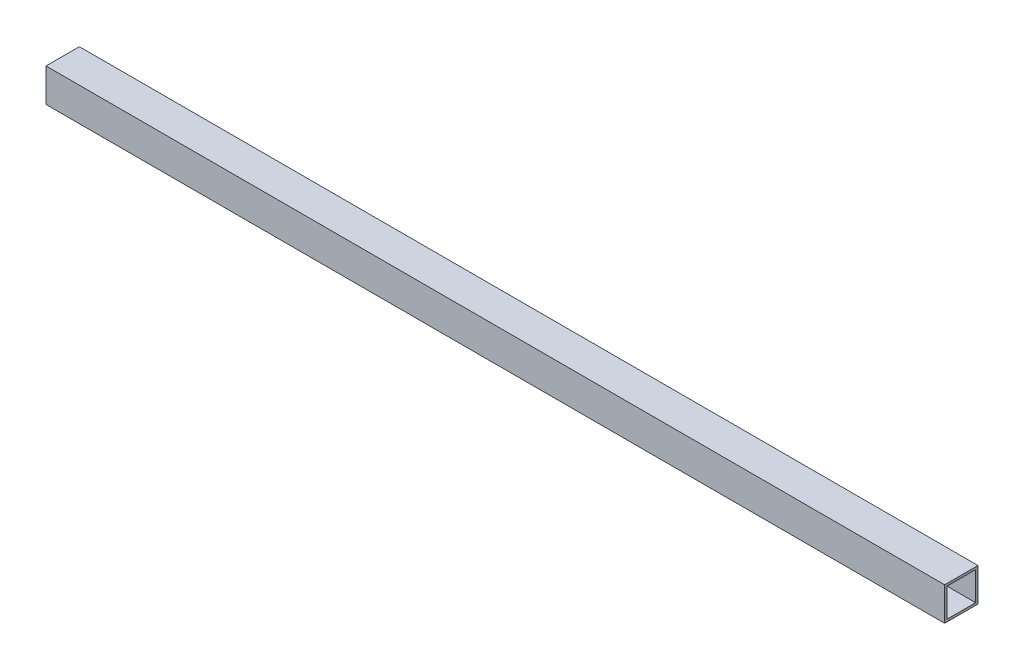
ISO-10303-21;
HEADER;
FILE_DESCRIPTION(('STEP AP214'),'2;1');
FILE_NAME('part.step','',(''),(''),'','','');
FILE_SCHEMA(('AUTOMOTIVE_DESIGN { 1 0 10303 214 1 1 1 1 }'));
ENDSEC;
DATA;
#1=APPLICATION_CONTEXT('core data for automotive mechanical design processes');
#2=APPLICATION_PROTOCOL_DEFINITION('international standard','automotive_design',2000,#1);
#3=PRODUCT_CONTEXT('',#1,'mechanical');
#4=PRODUCT('Part','Part','',(#3));
#5=PRODUCT_RELATED_PRODUCT_CATEGORY('part','',(#4));
#6=PRODUCT_DEFINITION_FORMATION('','',#4);
#7=PRODUCT_DEFINITION_CONTEXT('part definition',#1,'design');
#8=PRODUCT_DEFINITION('design','',#6,#7);
#9=PRODUCT_DEFINITION_SHAPE('','',#8);
#10=(LENGTH_UNIT() NAMED_UNIT(*) SI_UNIT(.MILLI.,.METRE.));
#11=(NAMED_UNIT(*) PLANE_ANGLE_UNIT() SI_UNIT($,.RADIAN.));
#12=(NAMED_UNIT(*) SI_UNIT($,.STERADIAN.) SOLID_ANGLE_UNIT());
#13=UNCERTAINTY_MEASURE_WITH_UNIT(LENGTH_MEASURE(1.E-05),#10,'distance_accuracy_value','');
#14=(GEOMETRIC_REPRESENTATION_CONTEXT(3) GLOBAL_UNCERTAINTY_ASSIGNED_CONTEXT((#13)) GLOBAL_UNIT_ASSIGNED_CONTEXT((#10,
#11,#12)) REPRESENTATION_CONTEXT('',''));
#15=CARTESIAN_POINT('',(0.,0.,0.));
#16=DIRECTION('',(0.,0.,1.));
#17=DIRECTION('',(1.,0.,0.));
#18=AXIS2_PLACEMENT_3D('',#15,#16,#17);
#19=CARTESIAN_POINT('',(1196.975,0.,0.));
#20=DIRECTION('',(-1.,0.,0.));
#21=DIRECTION('',(0.,0.,1.));
#22=AXIS2_PLACEMENT_3D('',#19,#20,#21);
#23=PLANE('',#22);
#24=DIRECTION('',(0.,-1.,0.));
#25=VECTOR('',#24,1.);
#26=CARTESIAN_POINT('',(1196.975,0.,0.));
#27=LINE('',#26,#25);
#28=CARTESIAN_POINT('',(1196.975,44.45,0.));
#29=VERTEX_POINT('',#28);
#30=CARTESIAN_POINT('',(1196.975,0.,0.));
#31=VERTEX_POINT('',#30);
#32=EDGE_CURVE('E138',#29,#31,#27,.T.);
#33=ORIENTED_EDGE('',*,*,#32,.T.);
#34=DIRECTION('',(0.,0.,-1.));
#35=VECTOR('',#34,1.);
#36=CARTESIAN_POINT('',(1196.975,0.,0.));
#37=LINE('',#36,#35);
#38=CARTESIAN_POINT('',(1196.975,0.,-44.45));
#39=VERTEX_POINT('',#38);
#40=EDGE_CURVE('E141',#31,#39,#37,.T.);
#41=ORIENTED_EDGE('',*,*,#40,.T.);
#42=DIRECTION('',(0.,1.,0.));
#43=VECTOR('',#42,1.);
#44=CARTESIAN_POINT('',(1196.975,0.,-44.45));
#45=LINE('',#44,#43);
#46=CARTESIAN_POINT('',(1196.975,44.45,-44.45));
#47=VERTEX_POINT('',#46);
#48=EDGE_CURVE('E144',#39,#47,#45,.T.);
#49=ORIENTED_EDGE('',*,*,#48,.T.);
#50=DIRECTION('',(0.,0.,1.));
#51=VECTOR('',#50,1.);
#52=CARTESIAN_POINT('',(1196.975,44.45,0.));
#53=LINE('',#52,#51);
#54=EDGE_CURVE('E146',#47,#29,#53,.T.);
#55=ORIENTED_EDGE('',*,*,#54,.T.);
#56=EDGE_LOOP('',(#33,#41,#49,#55));
#57=FACE_BOUND('',#56,.T.);
#58=DIRECTION('',(0.,-1.,0.));
#59=VECTOR('',#58,1.);
#60=CARTESIAN_POINT('',(1196.975,41.275,-3.175));
#61=LINE('',#60,#59);
#62=CARTESIAN_POINT('',(1196.975,41.275,-3.175));
#63=VERTEX_POINT('',#62);
#64=CARTESIAN_POINT('',(1196.975,3.175,-3.175));
#65=VERTEX_POINT('',#64);
#66=EDGE_CURVE('E102',#63,#65,#61,.T.);
#67=ORIENTED_EDGE('',*,*,#66,.F.);
#68=DIRECTION('',(0.,0.,1.));
#69=VECTOR('',#68,1.);
#70=CARTESIAN_POINT('',(1196.975,41.275,-3.175));
#71=LINE('',#70,#69);
#72=CARTESIAN_POINT('',(1196.975,41.275,-41.275));
#73=VERTEX_POINT('',#72);
#74=EDGE_CURVE('E124',#73,#63,#71,.T.);
#75=ORIENTED_EDGE('',*,*,#74,.F.);
#76=DIRECTION('',(0.,1.,0.));
#77=VECTOR('',#76,1.);
#78=CARTESIAN_POINT('',(1196.975,41.275,-41.275));
#79=LINE('',#78,#77);
#80=CARTESIAN_POINT('',(1196.975,3.175,-41.275));
#81=VERTEX_POINT('',#80);
#82=EDGE_CURVE('E122',#81,#73,#79,.T.);
#83=ORIENTED_EDGE('',*,*,#82,.F.);
#84=DIRECTION('',(0.,0.,-1.));
#85=VECTOR('',#84,1.);
#86=CARTESIAN_POINT('',(1196.975,3.175,-3.175));
#87=LINE('',#86,#85);
#88=EDGE_CURVE('E110',#65,#81,#87,.T.);
#89=ORIENTED_EDGE('',*,*,#88,.F.);
#90=EDGE_LOOP('',(#67,#75,#83,#89));
#91=FACE_BOUND('',#90,.T.);
#92=ADVANCED_FACE('F37',(#57,#91),#23,.F.);
#93=CARTESIAN_POINT('',(0.,0.,0.));
#94=DIRECTION('',(-1.,0.,0.));
#95=DIRECTION('',(0.,0.,1.));
#96=AXIS2_PLACEMENT_3D('',#93,#94,#95);
#97=PLANE('',#96);
#98=DIRECTION('',(0.,-1.,0.));
#99=VECTOR('',#98,1.);
#100=CARTESIAN_POINT('',(0.,0.,0.));
#101=LINE('',#100,#99);
#102=CARTESIAN_POINT('',(0.,44.45,0.));
#103=VERTEX_POINT('',#102);
#104=CARTESIAN_POINT('',(0.,0.,0.));
#105=VERTEX_POINT('',#104);
#106=EDGE_CURVE('E118',#103,#105,#101,.T.);
#107=ORIENTED_EDGE('',*,*,#106,.F.);
#108=DIRECTION('',(0.,0.,1.));
#109=VECTOR('',#108,1.);
#110=CARTESIAN_POINT('',(0.,44.45,0.));
#111=LINE('',#110,#109);
#112=CARTESIAN_POINT('',(0.,44.45,-44.45));
#113=VERTEX_POINT('',#112);
#114=EDGE_CURVE('E142',#113,#103,#111,.T.);
#115=ORIENTED_EDGE('',*,*,#114,.F.);
#116=DIRECTION('',(0.,1.,0.));
#117=VECTOR('',#116,1.);
#118=CARTESIAN_POINT('',(0.,0.,-44.45));
#119=LINE('',#118,#117);
#120=CARTESIAN_POINT('',(0.,0.,-44.45));
#121=VERTEX_POINT('',#120);
#122=EDGE_CURVE('E153',#121,#113,#119,.T.);
#123=ORIENTED_EDGE('',*,*,#122,.F.);
#124=DIRECTION('',(0.,0.,-1.));
#125=VECTOR('',#124,1.);
#126=CARTESIAN_POINT('',(0.,0.,0.));
#127=LINE('',#126,#125);
#128=EDGE_CURVE('E151',#105,#121,#127,.T.);
#129=ORIENTED_EDGE('',*,*,#128,.F.);
#130=EDGE_LOOP('',(#107,#115,#123,#129));
#131=FACE_BOUND('',#130,.T.);
#132=DIRECTION('',(0.,0.,1.));
#133=VECTOR('',#132,1.);
#134=CARTESIAN_POINT('',(0.,41.275,-3.175));
#135=LINE('',#134,#133);
#136=CARTESIAN_POINT('',(0.,41.275,-41.275));
#137=VERTEX_POINT('',#136);
#138=CARTESIAN_POINT('',(0.,41.275,-3.175));
#139=VERTEX_POINT('',#138);
#140=EDGE_CURVE('E111',#137,#139,#135,.T.);
#141=ORIENTED_EDGE('',*,*,#140,.T.);
#142=DIRECTION('',(0.,-1.,0.));
#143=VECTOR('',#142,1.);
#144=CARTESIAN_POINT('',(0.,41.275,-3.175));
#145=LINE('',#144,#143);
#146=CARTESIAN_POINT('',(0.,3.175,-3.175));
#147=VERTEX_POINT('',#146);
#148=EDGE_CURVE('E60',#139,#147,#145,.T.);
#149=ORIENTED_EDGE('',*,*,#148,.T.);
#150=DIRECTION('',(0.,0.,-1.));
#151=VECTOR('',#150,1.);
#152=CARTESIAN_POINT('',(0.,3.175,-3.175));
#153=LINE('',#152,#151);
#154=CARTESIAN_POINT('',(0.,3.175,-41.275));
#155=VERTEX_POINT('',#154);
#156=EDGE_CURVE('E117',#147,#155,#153,.T.);
#157=ORIENTED_EDGE('',*,*,#156,.T.);
#158=DIRECTION('',(0.,1.,0.));
#159=VECTOR('',#158,1.);
#160=CARTESIAN_POINT('',(0.,41.275,-41.275));
#161=LINE('',#160,#159);
#162=EDGE_CURVE('E130',#155,#137,#161,.T.);
#163=ORIENTED_EDGE('',*,*,#162,.T.);
#164=EDGE_LOOP('',(#141,#149,#157,#163));
#165=FACE_BOUND('',#164,.T.);
#166=ADVANCED_FACE('F171',(#131,#165),#97,.T.);
#167=CARTESIAN_POINT('',(1196.975,0.,0.));
#168=DIRECTION('',(0.,0.,-1.));
#169=DIRECTION('',(-1.,0.,0.));
#170=AXIS2_PLACEMENT_3D('',#167,#168,#169);
#171=PLANE('',#170);
#172=ORIENTED_EDGE('',*,*,#106,.T.);
#173=DIRECTION('',(-1.,0.,0.));
#174=VECTOR('',#173,1.);
#175=CARTESIAN_POINT('',(1196.975,0.,0.));
#176=LINE('',#175,#174);
#177=EDGE_CURVE('E11',#31,#105,#176,.T.);
#178=ORIENTED_EDGE('',*,*,#177,.F.);
#179=ORIENTED_EDGE('',*,*,#32,.F.);
#180=DIRECTION('',(-1.,0.,0.));
#181=VECTOR('',#180,1.);
#182=CARTESIAN_POINT('',(1196.975,44.45,0.));
#183=LINE('',#182,#181);
#184=EDGE_CURVE('E148',#29,#103,#183,.T.);
#185=ORIENTED_EDGE('',*,*,#184,.T.);
#186=EDGE_LOOP('',(#172,#178,#179,#185));
#187=FACE_BOUND('',#186,.T.);
#188=ADVANCED_FACE('F39',(#187),#171,.F.);
#189=CARTESIAN_POINT('',(1196.975,0.,0.));
#190=DIRECTION('',(0.,1.,0.));
#191=DIRECTION('',(0.,0.,1.));
#192=AXIS2_PLACEMENT_3D('',#189,#190,#191);
#193=PLANE('',#192);
#194=ORIENTED_EDGE('',*,*,#128,.T.);
#195=DIRECTION('',(-1.,0.,0.));
#196=VECTOR('',#195,1.);
#197=CARTESIAN_POINT('',(1196.975,0.,-44.45));
#198=LINE('',#197,#196);
#199=EDGE_CURVE('E45',#39,#121,#198,.T.);
#200=ORIENTED_EDGE('',*,*,#199,.F.);
#201=ORIENTED_EDGE('',*,*,#40,.F.);
#202=ORIENTED_EDGE('',*,*,#177,.T.);
#203=EDGE_LOOP('',(#194,#200,#201,#202));
#204=FACE_BOUND('',#203,.T.);
#205=ADVANCED_FACE('F181',(#204),#193,.F.);
#206=CARTESIAN_POINT('',(1196.975,0.,-44.45));
#207=DIRECTION('',(0.,0.,1.));
#208=DIRECTION('',(1.,0.,0.));
#209=AXIS2_PLACEMENT_3D('',#206,#207,#208);
#210=PLANE('',#209);
#211=ORIENTED_EDGE('',*,*,#122,.T.);
#212=DIRECTION('',(-1.,0.,0.));
#213=VECTOR('',#212,1.);
#214=CARTESIAN_POINT('',(1196.975,44.45,-44.45));
#215=LINE('',#214,#213);
#216=EDGE_CURVE('E158',#47,#113,#215,.T.);
#217=ORIENTED_EDGE('',*,*,#216,.F.);
#218=ORIENTED_EDGE('',*,*,#48,.F.);
#219=ORIENTED_EDGE('',*,*,#199,.T.);
#220=EDGE_LOOP('',(#211,#217,#218,#219));
#221=FACE_BOUND('',#220,.T.);
#222=ADVANCED_FACE('F165',(#221),#210,.F.);
#223=CARTESIAN_POINT('',(1196.975,44.45,0.));
#224=DIRECTION('',(0.,-1.,0.));
#225=DIRECTION('',(0.,0.,-1.));
#226=AXIS2_PLACEMENT_3D('',#223,#224,#225);
#227=PLANE('',#226);
#228=ORIENTED_EDGE('',*,*,#114,.T.);
#229=ORIENTED_EDGE('',*,*,#184,.F.);
#230=ORIENTED_EDGE('',*,*,#54,.F.);
#231=ORIENTED_EDGE('',*,*,#216,.T.);
#232=EDGE_LOOP('',(#228,#229,#230,#231));
#233=FACE_BOUND('',#232,.T.);
#234=ADVANCED_FACE('F175',(#233),#227,.F.);
#235=CARTESIAN_POINT('',(1196.975,41.275,-3.175));
#236=DIRECTION('',(0.,0.,-1.));
#237=DIRECTION('',(0.,1.,0.));
#238=AXIS2_PLACEMENT_3D('',#235,#236,#237);
#239=PLANE('',#238);
#240=ORIENTED_EDGE('',*,*,#148,.F.);
#241=DIRECTION('',(-1.,0.,0.));
#242=VECTOR('',#241,1.);
#243=CARTESIAN_POINT('',(1196.975,41.275,-3.175));
#244=LINE('',#243,#242);
#245=EDGE_CURVE('E106',#63,#139,#244,.T.);
#246=ORIENTED_EDGE('',*,*,#245,.F.);
#247=ORIENTED_EDGE('',*,*,#66,.T.);
#248=DIRECTION('',(-1.,0.,0.));
#249=VECTOR('',#248,1.);
#250=CARTESIAN_POINT('',(1196.975,3.175,-3.175));
#251=LINE('',#250,#249);
#252=EDGE_CURVE('E105',#65,#147,#251,.T.);
#253=ORIENTED_EDGE('',*,*,#252,.T.);
#254=EDGE_LOOP('',(#240,#246,#247,#253));
#255=FACE_BOUND('',#254,.T.);
#256=ADVANCED_FACE('F104',(#255),#239,.T.);
#257=CARTESIAN_POINT('',(1196.975,3.175,-3.175));
#258=DIRECTION('',(0.,1.,0.));
#259=DIRECTION('',(0.,0.,1.));
#260=AXIS2_PLACEMENT_3D('',#257,#258,#259);
#261=PLANE('',#260);
#262=ORIENTED_EDGE('',*,*,#156,.F.);
#263=ORIENTED_EDGE('',*,*,#252,.F.);
#264=ORIENTED_EDGE('',*,*,#88,.T.);
#265=DIRECTION('',(-1.,0.,0.));
#266=VECTOR('',#265,1.);
#267=CARTESIAN_POINT('',(1196.975,3.175,-41.275));
#268=LINE('',#267,#266);
#269=EDGE_CURVE('E119',#81,#155,#268,.T.);
#270=ORIENTED_EDGE('',*,*,#269,.T.);
#271=EDGE_LOOP('',(#262,#263,#264,#270));
#272=FACE_BOUND('',#271,.T.);
#273=ADVANCED_FACE('F114',(#272),#261,.T.);
#274=CARTESIAN_POINT('',(1196.975,41.275,-41.275));
#275=DIRECTION('',(0.,0.,1.));
#276=DIRECTION('',(0.,-1.,0.));
#277=AXIS2_PLACEMENT_3D('',#274,#275,#276);
#278=PLANE('',#277);
#279=ORIENTED_EDGE('',*,*,#162,.F.);
#280=ORIENTED_EDGE('',*,*,#269,.F.);
#281=ORIENTED_EDGE('',*,*,#82,.T.);
#282=DIRECTION('',(-1.,0.,0.));
#283=VECTOR('',#282,1.);
#284=CARTESIAN_POINT('',(1196.975,41.275,-41.275));
#285=LINE('',#284,#283);
#286=EDGE_CURVE('E52',#73,#137,#285,.T.);
#287=ORIENTED_EDGE('',*,*,#286,.T.);
#288=EDGE_LOOP('',(#279,#280,#281,#287));
#289=FACE_BOUND('',#288,.T.);
#290=ADVANCED_FACE('F204',(#289),#278,.T.);
#291=CARTESIAN_POINT('',(1196.975,41.275,-3.175));
#292=DIRECTION('',(0.,-1.,0.));
#293=DIRECTION('',(0.,0.,-1.));
#294=AXIS2_PLACEMENT_3D('',#291,#292,#293);
#295=PLANE('',#294);
#296=ORIENTED_EDGE('',*,*,#140,.F.);
#297=ORIENTED_EDGE('',*,*,#286,.F.);
#298=ORIENTED_EDGE('',*,*,#74,.T.);
#299=ORIENTED_EDGE('',*,*,#245,.T.);
#300=EDGE_LOOP('',(#296,#297,#298,#299));
#301=FACE_BOUND('',#300,.T.);
#302=ADVANCED_FACE('F208',(#301),#295,.T.);
#303=CLOSED_SHELL('',(#92,#166,#188,#205,#222,#234,#256,#273,#290,#302));
#304=MANIFOLD_SOLID_BREP('B2',#303);
#305=ADVANCED_BREP_SHAPE_REPRESENTATION('',(#18,#304),#14);
#306=SHAPE_DEFINITION_REPRESENTATION(#9,#305);
ENDSEC;
END-ISO-10303-21;
